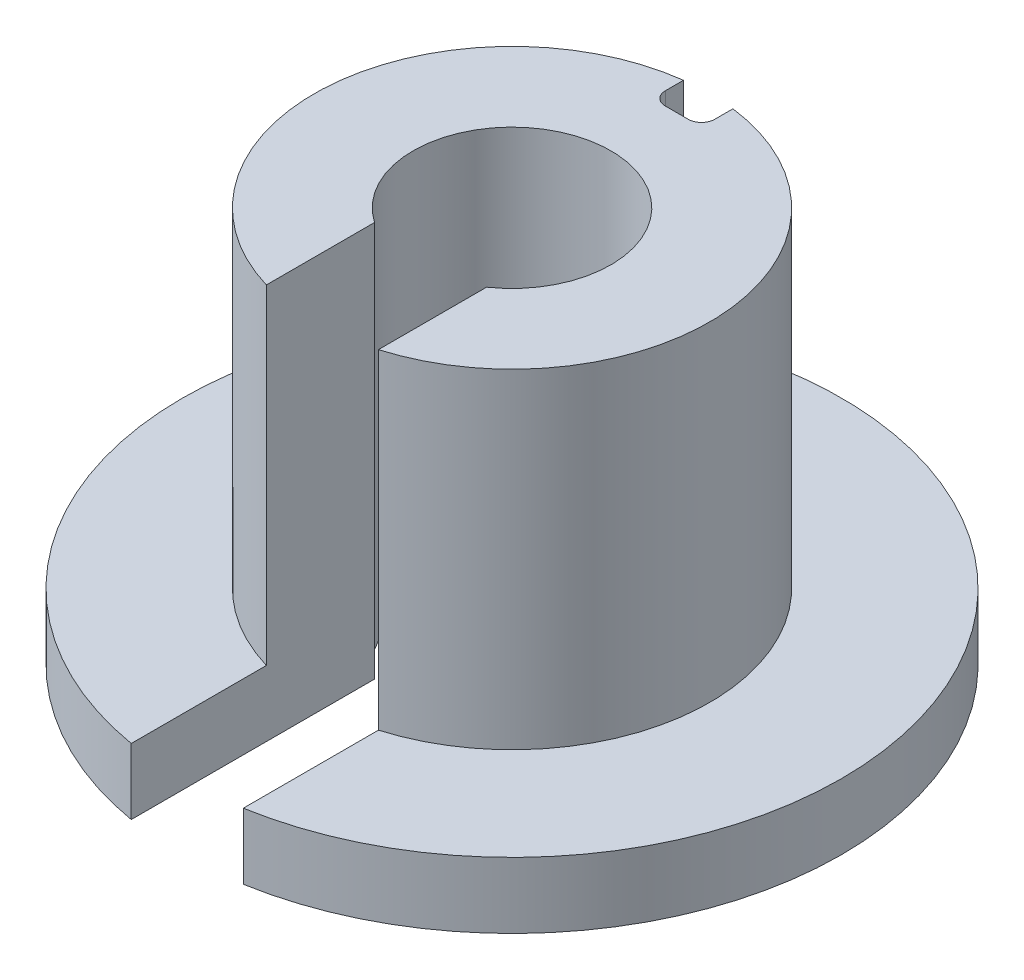
ISO-10303-21;
HEADER;
FILE_DESCRIPTION(('STEP AP214'),'2;1');
FILE_NAME('part.step','',(''),(''),'','','');
FILE_SCHEMA(('AUTOMOTIVE_DESIGN { 1 0 10303 214 1 1 1 1 }'));
ENDSEC;
DATA;
#1=APPLICATION_CONTEXT('core data for automotive mechanical design processes');
#2=APPLICATION_PROTOCOL_DEFINITION('international standard','automotive_design',2000,#1);
#3=PRODUCT_CONTEXT('',#1,'mechanical');
#4=PRODUCT('Part','Part','',(#3));
#5=PRODUCT_RELATED_PRODUCT_CATEGORY('part','',(#4));
#6=PRODUCT_DEFINITION_FORMATION('','',#4);
#7=PRODUCT_DEFINITION_CONTEXT('part definition',#1,'design');
#8=PRODUCT_DEFINITION('design','',#6,#7);
#9=PRODUCT_DEFINITION_SHAPE('','',#8);
#10=(LENGTH_UNIT() NAMED_UNIT(*) SI_UNIT(.MILLI.,.METRE.));
#11=(NAMED_UNIT(*) PLANE_ANGLE_UNIT() SI_UNIT($,.RADIAN.));
#12=(NAMED_UNIT(*) SI_UNIT($,.STERADIAN.) SOLID_ANGLE_UNIT());
#13=UNCERTAINTY_MEASURE_WITH_UNIT(LENGTH_MEASURE(1.E-05),#10,'distance_accuracy_value','');
#14=(GEOMETRIC_REPRESENTATION_CONTEXT(3) GLOBAL_UNCERTAINTY_ASSIGNED_CONTEXT((#13)) GLOBAL_UNIT_ASSIGNED_CONTEXT((#10,
#11,#12)) REPRESENTATION_CONTEXT('',''));
#15=CARTESIAN_POINT('',(0.,0.,0.));
#16=DIRECTION('',(0.,0.,1.));
#17=DIRECTION('',(1.,0.,0.));
#18=AXIS2_PLACEMENT_3D('',#15,#16,#17);
#19=CARTESIAN_POINT('',(0.,12.,0.));
#20=DIRECTION('',(0.,-1.,0.));
#21=DIRECTION('',(0.,0.,-1.));
#22=AXIS2_PLACEMENT_3D('',#19,#20,#21);
#23=CYLINDRICAL_SURFACE('',#22,6.);
#24=CARTESIAN_POINT('',(0.,12.,0.));
#25=DIRECTION('',(0.,1.,0.));
#26=DIRECTION('',(0.,0.,1.));
#27=AXIS2_PLACEMENT_3D('',#24,#25,#26);
#28=CIRCLE('',#27,6.);
#29=CARTESIAN_POINT('',(-0.75,12.,-5.95294044989533));
#30=VERTEX_POINT('',#29);
#31=CARTESIAN_POINT('',(-1.7,12.,5.75412895232632));
#32=VERTEX_POINT('',#31);
#33=EDGE_CURVE('E132',#30,#32,#28,.T.);
#34=ORIENTED_EDGE('',*,*,#33,.F.);
#35=DIRECTION('',(0.,1.,0.));
#36=VECTOR('',#35,1.);
#37=CARTESIAN_POINT('',(-0.75,0.197224362268005,-5.95294044989533));
#38=LINE('',#37,#36);
#39=CARTESIAN_POINT('',(-0.75,2.,-5.95294044989533));
#40=VERTEX_POINT('',#39);
#41=EDGE_CURVE('E121',#40,#30,#38,.T.);
#42=ORIENTED_EDGE('',*,*,#41,.F.);
#43=CARTESIAN_POINT('',(0.,2.,0.));
#44=DIRECTION('',(0.,1.,0.));
#45=DIRECTION('',(0.,0.,-1.));
#46=AXIS2_PLACEMENT_3D('',#43,#44,#45);
#47=CIRCLE('',#46,6.);
#48=CARTESIAN_POINT('',(-1.7,2.,5.75412895232632));
#49=VERTEX_POINT('',#48);
#50=EDGE_CURVE('E130',#40,#49,#47,.T.);
#51=ORIENTED_EDGE('',*,*,#50,.T.);
#52=DIRECTION('',(0.,-1.,0.));
#53=VECTOR('',#52,1.);
#54=CARTESIAN_POINT('',(-1.7,12.,5.75412895232632));
#55=LINE('',#54,#53);
#56=EDGE_CURVE('E184',#32,#49,#55,.T.);
#57=ORIENTED_EDGE('',*,*,#56,.F.);
#58=EDGE_LOOP('',(#34,#42,#51,#57));
#59=FACE_BOUND('',#58,.T.);
#60=ADVANCED_FACE('F33',(#59),#23,.T.);
#61=CARTESIAN_POINT('',(1.7,2.,5.75412895232632));
#62=VERTEX_POINT('',#61);
#63=CARTESIAN_POINT('',(0.75,2.,-5.95294044989533));
#64=VERTEX_POINT('',#63);
#65=EDGE_CURVE('E141',#62,#64,#47,.T.);
#66=ORIENTED_EDGE('',*,*,#65,.T.);
#67=DIRECTION('',(0.,1.,0.));
#68=VECTOR('',#67,1.);
#69=CARTESIAN_POINT('',(0.750000000000001,0.197224362268005,-5.95294044989533));
#70=LINE('',#69,#68);
#71=CARTESIAN_POINT('',(0.750000000000001,12.,-5.95294044989533));
#72=VERTEX_POINT('',#71);
#73=EDGE_CURVE('E155',#64,#72,#70,.T.);
#74=ORIENTED_EDGE('',*,*,#73,.T.);
#75=CARTESIAN_POINT('',(1.7,12.,5.75412895232632));
#76=VERTEX_POINT('',#75);
#77=EDGE_CURVE('E162',#76,#72,#28,.T.);
#78=ORIENTED_EDGE('',*,*,#77,.F.);
#79=DIRECTION('',(0.,-1.,0.));
#80=VECTOR('',#79,1.);
#81=CARTESIAN_POINT('',(1.7,12.,5.75412895232632));
#82=LINE('',#81,#80);
#83=EDGE_CURVE('E171',#76,#62,#82,.T.);
#84=ORIENTED_EDGE('',*,*,#83,.T.);
#85=EDGE_LOOP('',(#66,#74,#78,#84));
#86=FACE_BOUND('',#85,.T.);
#87=ADVANCED_FACE('F238',(#86),#23,.T.);
#88=CARTESIAN_POINT('',(-1.7,12.,2.47184141886166));
#89=DIRECTION('',(-1.,0.,0.));
#90=DIRECTION('',(0.,0.,1.));
#91=AXIS2_PLACEMENT_3D('',#88,#89,#90);
#92=PLANE('',#91);
#93=DIRECTION('',(0.,0.,-1.));
#94=VECTOR('',#93,1.);
#95=CARTESIAN_POINT('',(-1.7,0.,2.47184141886166));
#96=LINE('',#95,#94);
#97=CARTESIAN_POINT('',(-1.7,0.,9.85444062339411));
#98=VERTEX_POINT('',#97);
#99=CARTESIAN_POINT('',(-1.7,0.,2.47184141886166));
#100=VERTEX_POINT('',#99);
#101=EDGE_CURVE('E159',#98,#100,#96,.T.);
#102=ORIENTED_EDGE('',*,*,#101,.T.);
#103=DIRECTION('',(0.,-1.,0.));
#104=VECTOR('',#103,1.);
#105=CARTESIAN_POINT('',(-1.7,12.,2.47184141886166));
#106=LINE('',#105,#104);
#107=CARTESIAN_POINT('',(-1.7,12.,2.47184141886166));
#108=VERTEX_POINT('',#107);
#109=EDGE_CURVE('E181',#108,#100,#106,.T.);
#110=ORIENTED_EDGE('',*,*,#109,.F.);
#111=DIRECTION('',(0.,0.,-1.));
#112=VECTOR('',#111,1.);
#113=CARTESIAN_POINT('',(-1.7,12.,2.47184141886166));
#114=LINE('',#113,#112);
#115=EDGE_CURVE('E165',#32,#108,#114,.T.);
#116=ORIENTED_EDGE('',*,*,#115,.F.);
#117=ORIENTED_EDGE('',*,*,#56,.T.);
#118=DIRECTION('',(0.,0.,1.));
#119=VECTOR('',#118,1.);
#120=CARTESIAN_POINT('',(-1.7,2.,5.75412895232632));
#121=LINE('',#120,#119);
#122=CARTESIAN_POINT('',(-1.7,2.,9.85444062339411));
#123=VERTEX_POINT('',#122);
#124=EDGE_CURVE('E140',#49,#123,#121,.T.);
#125=ORIENTED_EDGE('',*,*,#124,.T.);
#126=DIRECTION('',(0.,-1.,0.));
#127=VECTOR('',#126,1.);
#128=CARTESIAN_POINT('',(-1.7,2.,9.85444062339411));
#129=LINE('',#128,#127);
#130=EDGE_CURVE('E156',#123,#98,#129,.T.);
#131=ORIENTED_EDGE('',*,*,#130,.T.);
#132=EDGE_LOOP('',(#102,#110,#116,#117,#125,#131));
#133=FACE_BOUND('',#132,.T.);
#134=ADVANCED_FACE('F231',(#133),#92,.F.);
#135=CARTESIAN_POINT('',(0.,12.,0.));
#136=DIRECTION('',(0.,-1.,0.));
#137=DIRECTION('',(0.,0.,-1.));
#138=AXIS2_PLACEMENT_3D('',#135,#136,#137);
#139=CYLINDRICAL_SURFACE('',#138,3.);
#140=CARTESIAN_POINT('',(0.,0.,0.));
#141=DIRECTION('',(0.,-1.,0.));
#142=DIRECTION('',(0.,0.,1.));
#143=AXIS2_PLACEMENT_3D('',#140,#141,#142);
#144=CIRCLE('',#143,3.);
#145=CARTESIAN_POINT('',(1.7,0.,2.47184141886166));
#146=VERTEX_POINT('',#145);
#147=EDGE_CURVE('E173',#100,#146,#144,.T.);
#148=ORIENTED_EDGE('',*,*,#147,.T.);
#149=DIRECTION('',(0.,-1.,0.));
#150=VECTOR('',#149,1.);
#151=CARTESIAN_POINT('',(1.7,12.,2.47184141886166));
#152=LINE('',#151,#150);
#153=CARTESIAN_POINT('',(1.7,12.,2.47184141886166));
#154=VERTEX_POINT('',#153);
#155=EDGE_CURVE('E178',#154,#146,#152,.T.);
#156=ORIENTED_EDGE('',*,*,#155,.F.);
#157=CARTESIAN_POINT('',(0.,12.,0.));
#158=DIRECTION('',(0.,-1.,0.));
#159=DIRECTION('',(0.,0.,1.));
#160=AXIS2_PLACEMENT_3D('',#157,#158,#159);
#161=CIRCLE('',#160,3.);
#162=EDGE_CURVE('E167',#108,#154,#161,.T.);
#163=ORIENTED_EDGE('',*,*,#162,.F.);
#164=ORIENTED_EDGE('',*,*,#109,.T.);
#165=EDGE_LOOP('',(#148,#156,#163,#164));
#166=FACE_BOUND('',#165,.T.);
#167=ADVANCED_FACE('F248',(#166),#139,.F.);
#168=CARTESIAN_POINT('',(1.7,12.,2.47184141886166));
#169=DIRECTION('',(1.,0.,0.));
#170=DIRECTION('',(0.,0.,-1.));
#171=AXIS2_PLACEMENT_3D('',#168,#169,#170);
#172=PLANE('',#171);
#173=DIRECTION('',(0.,0.,1.));
#174=VECTOR('',#173,1.);
#175=CARTESIAN_POINT('',(1.7,0.,2.47184141886166));
#176=LINE('',#175,#174);
#177=CARTESIAN_POINT('',(1.7,0.,9.8544406233941));
#178=VERTEX_POINT('',#177);
#179=EDGE_CURVE('E175',#146,#178,#176,.T.);
#180=ORIENTED_EDGE('',*,*,#179,.T.);
#181=DIRECTION('',(0.,-1.,0.));
#182=VECTOR('',#181,1.);
#183=CARTESIAN_POINT('',(1.7,2.,9.8544406233941));
#184=LINE('',#183,#182);
#185=CARTESIAN_POINT('',(1.7,2.,9.8544406233941));
#186=VERTEX_POINT('',#185);
#187=EDGE_CURVE('E151',#186,#178,#184,.T.);
#188=ORIENTED_EDGE('',*,*,#187,.F.);
#189=DIRECTION('',(0.,0.,-1.));
#190=VECTOR('',#189,1.);
#191=CARTESIAN_POINT('',(1.7,2.,5.75412895232632));
#192=LINE('',#191,#190);
#193=EDGE_CURVE('E142',#186,#62,#192,.T.);
#194=ORIENTED_EDGE('',*,*,#193,.T.);
#195=ORIENTED_EDGE('',*,*,#83,.F.);
#196=DIRECTION('',(0.,0.,1.));
#197=VECTOR('',#196,1.);
#198=CARTESIAN_POINT('',(1.7,12.,2.47184141886166));
#199=LINE('',#198,#197);
#200=EDGE_CURVE('E169',#154,#76,#199,.T.);
#201=ORIENTED_EDGE('',*,*,#200,.F.);
#202=ORIENTED_EDGE('',*,*,#155,.T.);
#203=EDGE_LOOP('',(#180,#188,#194,#195,#201,#202));
#204=FACE_BOUND('',#203,.T.);
#205=ADVANCED_FACE('F242',(#204),#172,.F.);
#206=CARTESIAN_POINT('',(0.,12.,0.));
#207=DIRECTION('',(0.,1.,0.));
#208=DIRECTION('',(0.,0.,1.));
#209=AXIS2_PLACEMENT_3D('',#206,#207,#208);
#210=PLANE('',#209);
#211=DIRECTION('',(0.,0.,1.));
#212=VECTOR('',#211,1.);
#213=CARTESIAN_POINT('',(-0.75,12.,-5.95294044989533));
#214=LINE('',#213,#212);
#215=CARTESIAN_POINT('',(-0.75,12.,-5.4));
#216=VERTEX_POINT('',#215);
#217=EDGE_CURVE('E209',#30,#216,#214,.T.);
#218=ORIENTED_EDGE('',*,*,#217,.F.);
#219=ORIENTED_EDGE('',*,*,#33,.T.);
#220=ORIENTED_EDGE('',*,*,#115,.T.);
#221=ORIENTED_EDGE('',*,*,#162,.T.);
#222=ORIENTED_EDGE('',*,*,#200,.T.);
#223=ORIENTED_EDGE('',*,*,#77,.T.);
#224=DIRECTION('',(0.,0.,-1.));
#225=VECTOR('',#224,1.);
#226=CARTESIAN_POINT('',(0.75,12.,-5.95294044989533));
#227=LINE('',#226,#225);
#228=CARTESIAN_POINT('',(0.75,12.,-5.4));
#229=VERTEX_POINT('',#228);
#230=EDGE_CURVE('E201',#229,#72,#227,.T.);
#231=ORIENTED_EDGE('',*,*,#230,.F.);
#232=CARTESIAN_POINT('',(0.35,12.,-5.4));
#233=DIRECTION('',(0.,1.,0.));
#234=DIRECTION('',(0.,0.,1.));
#235=AXIS2_PLACEMENT_3D('',#232,#233,#234);
#236=CIRCLE('',#235,0.4);
#237=CARTESIAN_POINT('',(0.35,12.,-5.));
#238=VERTEX_POINT('',#237);
#239=EDGE_CURVE('E41',#229,#238,#236,.F.);
#240=ORIENTED_EDGE('',*,*,#239,.T.);
#241=DIRECTION('',(1.,0.,0.));
#242=VECTOR('',#241,1.);
#243=CARTESIAN_POINT('',(-0.75,12.,-5.));
#244=LINE('',#243,#242);
#245=CARTESIAN_POINT('',(-0.35,12.,-5.));
#246=VERTEX_POINT('',#245);
#247=EDGE_CURVE('E133',#246,#238,#244,.T.);
#248=ORIENTED_EDGE('',*,*,#247,.F.);
#249=CARTESIAN_POINT('',(-0.35,12.,-5.4));
#250=DIRECTION('',(0.,1.,0.));
#251=DIRECTION('',(0.,0.,1.));
#252=AXIS2_PLACEMENT_3D('',#249,#250,#251);
#253=CIRCLE('',#252,0.4);
#254=EDGE_CURVE('E11',#246,#216,#253,.F.);
#255=ORIENTED_EDGE('',*,*,#254,.T.);
#256=EDGE_LOOP('',(#218,#219,#220,#221,#222,#223,#231,#240,#248,#255));
#257=FACE_BOUND('',#256,.T.);
#258=ADVANCED_FACE('F200',(#257),#210,.T.);
#259=CARTESIAN_POINT('',(0.,0.,0.));
#260=DIRECTION('',(0.,1.,0.));
#261=DIRECTION('',(0.,0.,1.));
#262=AXIS2_PLACEMENT_3D('',#259,#260,#261);
#263=PLANE('',#262);
#264=ORIENTED_EDGE('',*,*,#101,.F.);
#265=CARTESIAN_POINT('',(0.,0.,0.));
#266=DIRECTION('',(0.,-1.,0.));
#267=DIRECTION('',(0.,0.,-1.));
#268=AXIS2_PLACEMENT_3D('',#265,#266,#267);
#269=CIRCLE('',#268,10.);
#270=EDGE_CURVE('E152',#98,#178,#269,.T.);
#271=ORIENTED_EDGE('',*,*,#270,.T.);
#272=ORIENTED_EDGE('',*,*,#179,.F.);
#273=ORIENTED_EDGE('',*,*,#147,.F.);
#274=EDGE_LOOP('',(#264,#271,#272,#273));
#275=FACE_BOUND('',#274,.T.);
#276=ADVANCED_FACE('F246',(#275),#263,.F.);
#277=CARTESIAN_POINT('',(0.,2.,0.));
#278=DIRECTION('',(0.,-1.,0.));
#279=DIRECTION('',(0.,0.,-1.));
#280=AXIS2_PLACEMENT_3D('',#277,#278,#279);
#281=CYLINDRICAL_SURFACE('',#280,10.);
#282=ORIENTED_EDGE('',*,*,#270,.F.);
#283=ORIENTED_EDGE('',*,*,#130,.F.);
#284=CARTESIAN_POINT('',(0.,2.,0.));
#285=DIRECTION('',(0.,-1.,0.));
#286=DIRECTION('',(0.,0.,-1.));
#287=AXIS2_PLACEMENT_3D('',#284,#285,#286);
#288=CIRCLE('',#287,10.);
#289=EDGE_CURVE('E146',#123,#186,#288,.T.);
#290=ORIENTED_EDGE('',*,*,#289,.T.);
#291=ORIENTED_EDGE('',*,*,#187,.T.);
#292=EDGE_LOOP('',(#282,#283,#290,#291));
#293=FACE_BOUND('',#292,.T.);
#294=ADVANCED_FACE('F228',(#293),#281,.T.);
#295=CARTESIAN_POINT('',(0.,2.,0.));
#296=DIRECTION('',(0.,-1.,0.));
#297=DIRECTION('',(0.,0.,-1.));
#298=AXIS2_PLACEMENT_3D('',#295,#296,#297);
#299=PLANE('',#298);
#300=DIRECTION('',(1.,0.,0.));
#301=VECTOR('',#300,1.);
#302=CARTESIAN_POINT('',(-0.75,2.,-5.));
#303=LINE('',#302,#301);
#304=CARTESIAN_POINT('',(-0.35,2.,-5.));
#305=VERTEX_POINT('',#304);
#306=CARTESIAN_POINT('',(0.35,2.,-5.));
#307=VERTEX_POINT('',#306);
#308=EDGE_CURVE('E125',#305,#307,#303,.T.);
#309=ORIENTED_EDGE('',*,*,#308,.T.);
#310=CARTESIAN_POINT('',(0.35,2.,-5.4));
#311=DIRECTION('',(0.,-1.,0.));
#312=DIRECTION('',(0.,0.,-1.));
#313=AXIS2_PLACEMENT_3D('',#310,#311,#312);
#314=CIRCLE('',#313,0.4);
#315=CARTESIAN_POINT('',(0.75,2.,-5.4));
#316=VERTEX_POINT('',#315);
#317=EDGE_CURVE('E196',#307,#316,#314,.F.);
#318=ORIENTED_EDGE('',*,*,#317,.T.);
#319=DIRECTION('',(0.,0.,-1.));
#320=VECTOR('',#319,1.);
#321=CARTESIAN_POINT('',(0.75,2.,-5.95294044989533));
#322=LINE('',#321,#320);
#323=EDGE_CURVE('E215',#316,#64,#322,.T.);
#324=ORIENTED_EDGE('',*,*,#323,.T.);
#325=ORIENTED_EDGE('',*,*,#65,.F.);
#326=ORIENTED_EDGE('',*,*,#193,.F.);
#327=ORIENTED_EDGE('',*,*,#289,.F.);
#328=ORIENTED_EDGE('',*,*,#124,.F.);
#329=ORIENTED_EDGE('',*,*,#50,.F.);
#330=DIRECTION('',(0.,0.,1.));
#331=VECTOR('',#330,1.);
#332=CARTESIAN_POINT('',(-0.75,2.,-5.95294044989533));
#333=LINE('',#332,#331);
#334=CARTESIAN_POINT('',(-0.75,2.,-5.4));
#335=VERTEX_POINT('',#334);
#336=EDGE_CURVE('E118',#40,#335,#333,.T.);
#337=ORIENTED_EDGE('',*,*,#336,.T.);
#338=CARTESIAN_POINT('',(-0.35,2.,-5.4));
#339=DIRECTION('',(0.,-1.,0.));
#340=DIRECTION('',(0.,0.,-1.));
#341=AXIS2_PLACEMENT_3D('',#338,#339,#340);
#342=CIRCLE('',#341,0.4);
#343=EDGE_CURVE('E194',#335,#305,#342,.F.);
#344=ORIENTED_EDGE('',*,*,#343,.T.);
#345=EDGE_LOOP('',(#309,#318,#324,#325,#326,#327,#328,#329,#337,#344));
#346=FACE_BOUND('',#345,.T.);
#347=ADVANCED_FACE('F137',(#346),#299,.F.);
#348=CARTESIAN_POINT('',(-0.75,0.197224362268005,-5.95294044989533));
#349=DIRECTION('',(-1.,0.,0.));
#350=DIRECTION('',(0.,0.,1.));
#351=AXIS2_PLACEMENT_3D('',#348,#349,#350);
#352=PLANE('',#351);
#353=ORIENTED_EDGE('',*,*,#217,.T.);
#354=DIRECTION('',(0.,1.,0.));
#355=VECTOR('',#354,1.);
#356=CARTESIAN_POINT('',(-0.75,2.,-5.4));
#357=LINE('',#356,#355);
#358=EDGE_CURVE('E53',#216,#335,#357,.F.);
#359=ORIENTED_EDGE('',*,*,#358,.T.);
#360=ORIENTED_EDGE('',*,*,#336,.F.);
#361=ORIENTED_EDGE('',*,*,#41,.T.);
#362=EDGE_LOOP('',(#353,#359,#360,#361));
#363=FACE_BOUND('',#362,.T.);
#364=ADVANCED_FACE('F120',(#363),#352,.F.);
#365=CARTESIAN_POINT('',(-0.75,0.197224362268005,-5.));
#366=DIRECTION('',(0.,0.,1.));
#367=DIRECTION('',(1.,0.,0.));
#368=AXIS2_PLACEMENT_3D('',#365,#366,#367);
#369=PLANE('',#368);
#370=ORIENTED_EDGE('',*,*,#247,.T.);
#371=DIRECTION('',(0.,1.,0.));
#372=VECTOR('',#371,1.);
#373=CARTESIAN_POINT('',(0.35,2.,-5.));
#374=LINE('',#373,#372);
#375=EDGE_CURVE('E192',#238,#307,#374,.F.);
#376=ORIENTED_EDGE('',*,*,#375,.T.);
#377=ORIENTED_EDGE('',*,*,#308,.F.);
#378=DIRECTION('',(0.,1.,0.));
#379=VECTOR('',#378,1.);
#380=CARTESIAN_POINT('',(-0.35,12.,-5.));
#381=LINE('',#380,#379);
#382=EDGE_CURVE('E189',#305,#246,#381,.T.);
#383=ORIENTED_EDGE('',*,*,#382,.T.);
#384=EDGE_LOOP('',(#370,#376,#377,#383));
#385=FACE_BOUND('',#384,.T.);
#386=ADVANCED_FACE('F206',(#385),#369,.F.);
#387=CARTESIAN_POINT('',(0.75,0.197224362268005,-5.95294044989533));
#388=DIRECTION('',(1.,0.,0.));
#389=DIRECTION('',(0.,0.,-1.));
#390=AXIS2_PLACEMENT_3D('',#387,#388,#389);
#391=PLANE('',#390);
#392=ORIENTED_EDGE('',*,*,#323,.F.);
#393=DIRECTION('',(0.,1.,0.));
#394=VECTOR('',#393,1.);
#395=CARTESIAN_POINT('',(0.75,12.,-5.4));
#396=LINE('',#395,#394);
#397=EDGE_CURVE('E186',#316,#229,#396,.T.);
#398=ORIENTED_EDGE('',*,*,#397,.T.);
#399=ORIENTED_EDGE('',*,*,#230,.T.);
#400=ORIENTED_EDGE('',*,*,#73,.F.);
#401=EDGE_LOOP('',(#392,#398,#399,#400));
#402=FACE_BOUND('',#401,.T.);
#403=ADVANCED_FACE('F218',(#402),#391,.F.);
#404=CARTESIAN_POINT('',(0.35,0.197224362268005,-5.4));
#405=DIRECTION('',(0.,-1.,0.));
#406=DIRECTION('',(0.,0.,-1.));
#407=AXIS2_PLACEMENT_3D('',#404,#405,#406);
#408=CYLINDRICAL_SURFACE('',#407,0.4);
#409=ORIENTED_EDGE('',*,*,#317,.F.);
#410=ORIENTED_EDGE('',*,*,#375,.F.);
#411=ORIENTED_EDGE('',*,*,#239,.F.);
#412=ORIENTED_EDGE('',*,*,#397,.F.);
#413=EDGE_LOOP('',(#409,#410,#411,#412));
#414=FACE_BOUND('',#413,.T.);
#415=ADVANCED_FACE('F212',(#414),#408,.F.);
#416=CARTESIAN_POINT('',(-0.35,0.197224362268005,-5.4));
#417=DIRECTION('',(0.,-1.,0.));
#418=DIRECTION('',(0.,0.,-1.));
#419=AXIS2_PLACEMENT_3D('',#416,#417,#418);
#420=CYLINDRICAL_SURFACE('',#419,0.4);
#421=ORIENTED_EDGE('',*,*,#343,.F.);
#422=ORIENTED_EDGE('',*,*,#358,.F.);
#423=ORIENTED_EDGE('',*,*,#254,.F.);
#424=ORIENTED_EDGE('',*,*,#382,.F.);
#425=EDGE_LOOP('',(#421,#422,#423,#424));
#426=FACE_BOUND('',#425,.T.);
#427=ADVANCED_FACE('F35',(#426),#420,.F.);
#428=CLOSED_SHELL('',(#60,#87,#134,#167,#205,#258,#276,#294,#347,#364,#386,#403,#415,#427));
#429=MANIFOLD_SOLID_BREP('B2',#428);
#430=ADVANCED_BREP_SHAPE_REPRESENTATION('',(#18,#429),#14);
#431=SHAPE_DEFINITION_REPRESENTATION(#9,#430);
ENDSEC;
END-ISO-10303-21;
